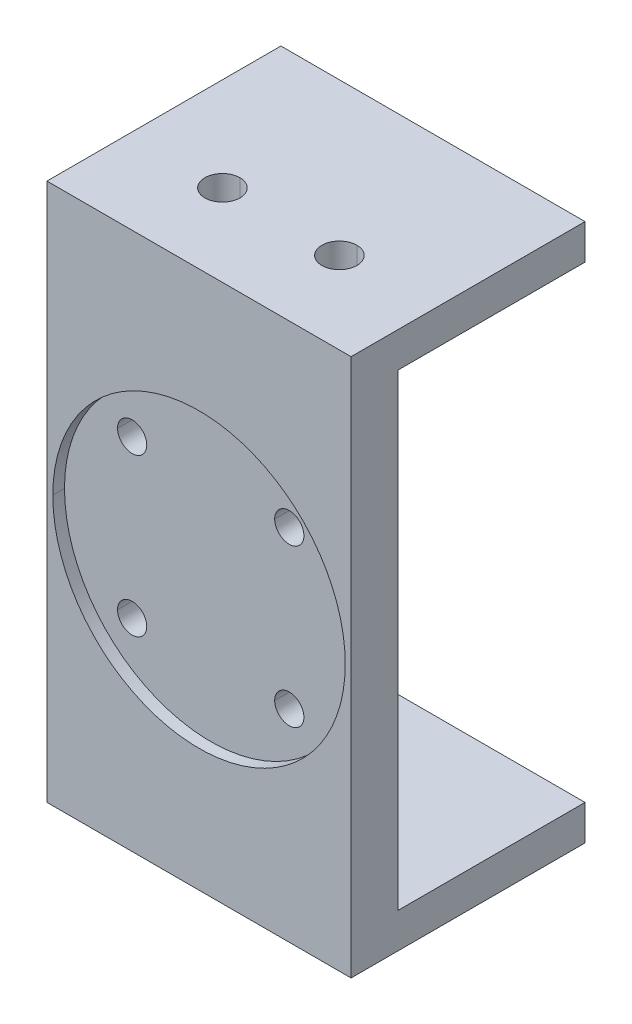
ISO-10303-21;
HEADER;
FILE_DESCRIPTION(('STEP AP214'),'2;1');
FILE_NAME('part.step','',(''),(''),'','','');
FILE_SCHEMA(('AUTOMOTIVE_DESIGN { 1 0 10303 214 1 1 1 1 }'));
ENDSEC;
DATA;
#1=APPLICATION_CONTEXT('core data for automotive mechanical design processes');
#2=APPLICATION_PROTOCOL_DEFINITION('international standard','automotive_design',2000,#1);
#3=PRODUCT_CONTEXT('',#1,'mechanical');
#4=PRODUCT('Part','Part','',(#3));
#5=PRODUCT_RELATED_PRODUCT_CATEGORY('part','',(#4));
#6=PRODUCT_DEFINITION_FORMATION('','',#4);
#7=PRODUCT_DEFINITION_CONTEXT('part definition',#1,'design');
#8=PRODUCT_DEFINITION('design','',#6,#7);
#9=PRODUCT_DEFINITION_SHAPE('','',#8);
#10=(LENGTH_UNIT() NAMED_UNIT(*) SI_UNIT(.MILLI.,.METRE.));
#11=(NAMED_UNIT(*) PLANE_ANGLE_UNIT() SI_UNIT($,.RADIAN.));
#12=(NAMED_UNIT(*) SI_UNIT($,.STERADIAN.) SOLID_ANGLE_UNIT());
#13=UNCERTAINTY_MEASURE_WITH_UNIT(LENGTH_MEASURE(1.E-05),#10,'distance_accuracy_value','');
#14=(GEOMETRIC_REPRESENTATION_CONTEXT(3) GLOBAL_UNCERTAINTY_ASSIGNED_CONTEXT((#13)) GLOBAL_UNIT_ASSIGNED_CONTEXT((#10,
#11,#12)) REPRESENTATION_CONTEXT('',''));
#15=CARTESIAN_POINT('',(0.,0.,0.));
#16=DIRECTION('',(0.,0.,1.));
#17=DIRECTION('',(1.,0.,0.));
#18=AXIS2_PLACEMENT_3D('',#15,#16,#17);
#19=CARTESIAN_POINT('',(-5.,-23.,-7.));
#20=DIRECTION('',(0.,1.,0.));
#21=DIRECTION('',(0.,0.,1.));
#22=AXIS2_PLACEMENT_3D('',#19,#20,#21);
#23=CYLINDRICAL_SURFACE('',#22,1.5);
#24=DIRECTION('',(0.,1.,0.));
#25=VECTOR('',#24,1.);
#26=CARTESIAN_POINT('',(-5.,-23.,-8.5));
#27=LINE('',#26,#25);
#28=CARTESIAN_POINT('',(-5.,-23.,-8.5));
#29=VERTEX_POINT('',#28);
#30=CARTESIAN_POINT('',(-5.,-20.,-8.5));
#31=VERTEX_POINT('',#30);
#32=EDGE_CURVE('E466',#29,#31,#27,.T.);
#33=ORIENTED_EDGE('',*,*,#32,.F.);
#34=CARTESIAN_POINT('',(-5.,-23.,-7.));
#35=DIRECTION('',(0.,1.,0.));
#36=DIRECTION('',(0.,0.,-1.));
#37=AXIS2_PLACEMENT_3D('',#34,#35,#36);
#38=CIRCLE('',#37,1.5);
#39=CARTESIAN_POINT('',(-5.,-23.,-5.5));
#40=VERTEX_POINT('',#39);
#41=EDGE_CURVE('E455',#40,#29,#38,.T.);
#42=ORIENTED_EDGE('',*,*,#41,.F.);
#43=DIRECTION('',(0.,1.,0.));
#44=VECTOR('',#43,1.);
#45=CARTESIAN_POINT('',(-5.,-23.,-5.5));
#46=LINE('',#45,#44);
#47=CARTESIAN_POINT('',(-5.,-20.,-5.5));
#48=VERTEX_POINT('',#47);
#49=EDGE_CURVE('E447',#40,#48,#46,.T.);
#50=ORIENTED_EDGE('',*,*,#49,.T.);
#51=CARTESIAN_POINT('',(-5.,-20.,-7.));
#52=DIRECTION('',(0.,-1.,0.));
#53=DIRECTION('',(0.,0.,-1.));
#54=AXIS2_PLACEMENT_3D('',#51,#52,#53);
#55=CIRCLE('',#54,1.5);
#56=EDGE_CURVE('E356',#31,#48,#55,.T.);
#57=ORIENTED_EDGE('',*,*,#56,.F.);
#58=EDGE_LOOP('',(#33,#42,#50,#57));
#59=FACE_BOUND('',#58,.T.);
#60=ADVANCED_FACE('F16',(#59),#23,.F.);
#61=CARTESIAN_POINT('',(-5.,-23.,-7.));
#62=DIRECTION('',(0.,1.,0.));
#63=DIRECTION('',(0.,0.,1.));
#64=AXIS2_PLACEMENT_3D('',#61,#62,#63);
#65=CYLINDRICAL_SURFACE('',#64,1.5);
#66=DIRECTION('',(0.,1.,0.));
#67=VECTOR('',#66,1.);
#68=CARTESIAN_POINT('',(-5.,-23.,-8.5));
#69=LINE('',#68,#67);
#70=CARTESIAN_POINT('',(-5.,20.,-8.5));
#71=VERTEX_POINT('',#70);
#72=CARTESIAN_POINT('',(-5.,23.,-8.5));
#73=VERTEX_POINT('',#72);
#74=EDGE_CURVE('E435',#71,#73,#69,.T.);
#75=ORIENTED_EDGE('',*,*,#74,.F.);
#76=CARTESIAN_POINT('',(-5.,20.,-7.));
#77=DIRECTION('',(0.,1.,0.));
#78=DIRECTION('',(0.,0.,1.));
#79=AXIS2_PLACEMENT_3D('',#76,#77,#78);
#80=CIRCLE('',#79,1.5);
#81=CARTESIAN_POINT('',(-5.,20.,-5.5));
#82=VERTEX_POINT('',#81);
#83=EDGE_CURVE('E307',#82,#71,#80,.T.);
#84=ORIENTED_EDGE('',*,*,#83,.F.);
#85=DIRECTION('',(0.,1.,0.));
#86=VECTOR('',#85,1.);
#87=CARTESIAN_POINT('',(-5.,-23.,-5.5));
#88=LINE('',#87,#86);
#89=CARTESIAN_POINT('',(-5.,23.,-5.5));
#90=VERTEX_POINT('',#89);
#91=EDGE_CURVE('E363',#82,#90,#88,.T.);
#92=ORIENTED_EDGE('',*,*,#91,.T.);
#93=CARTESIAN_POINT('',(-5.,23.,-7.));
#94=DIRECTION('',(0.,1.,0.));
#95=DIRECTION('',(0.,0.,-1.));
#96=AXIS2_PLACEMENT_3D('',#93,#94,#95);
#97=CIRCLE('',#96,1.5);
#98=EDGE_CURVE('E283',#90,#73,#97,.T.);
#99=ORIENTED_EDGE('',*,*,#98,.T.);
#100=EDGE_LOOP('',(#75,#84,#92,#99));
#101=FACE_BOUND('',#100,.T.);
#102=ADVANCED_FACE('F596',(#101),#65,.F.);
#103=CARTESIAN_POINT('',(5.,-23.,-7.));
#104=DIRECTION('',(0.,1.,0.));
#105=DIRECTION('',(0.,0.,1.));
#106=AXIS2_PLACEMENT_3D('',#103,#104,#105);
#107=CYLINDRICAL_SURFACE('',#106,1.5);
#108=DIRECTION('',(0.,1.,0.));
#109=VECTOR('',#108,1.);
#110=CARTESIAN_POINT('',(5.,-23.,-8.5));
#111=LINE('',#110,#109);
#112=CARTESIAN_POINT('',(5.,-23.,-8.5));
#113=VERTEX_POINT('',#112);
#114=CARTESIAN_POINT('',(5.,-20.,-8.5));
#115=VERTEX_POINT('',#114);
#116=EDGE_CURVE('E408',#113,#115,#111,.T.);
#117=ORIENTED_EDGE('',*,*,#116,.F.);
#118=CARTESIAN_POINT('',(5.,-23.,-7.));
#119=DIRECTION('',(0.,1.,0.));
#120=DIRECTION('',(0.,0.,1.));
#121=AXIS2_PLACEMENT_3D('',#118,#119,#120);
#122=CIRCLE('',#121,1.5);
#123=CARTESIAN_POINT('',(5.,-23.,-5.5));
#124=VERTEX_POINT('',#123);
#125=EDGE_CURVE('E517',#124,#113,#122,.T.);
#126=ORIENTED_EDGE('',*,*,#125,.F.);
#127=DIRECTION('',(0.,1.,0.));
#128=VECTOR('',#127,1.);
#129=CARTESIAN_POINT('',(5.,-23.,-5.5));
#130=LINE('',#129,#128);
#131=CARTESIAN_POINT('',(5.,-20.,-5.5));
#132=VERTEX_POINT('',#131);
#133=EDGE_CURVE('E301',#124,#132,#130,.T.);
#134=ORIENTED_EDGE('',*,*,#133,.T.);
#135=CARTESIAN_POINT('',(5.,-20.,-7.));
#136=DIRECTION('',(0.,-1.,0.));
#137=DIRECTION('',(0.,0.,-1.));
#138=AXIS2_PLACEMENT_3D('',#135,#136,#137);
#139=CIRCLE('',#138,1.5);
#140=EDGE_CURVE('E351',#115,#132,#139,.T.);
#141=ORIENTED_EDGE('',*,*,#140,.F.);
#142=EDGE_LOOP('',(#117,#126,#134,#141));
#143=FACE_BOUND('',#142,.T.);
#144=ADVANCED_FACE('F601',(#143),#107,.F.);
#145=CARTESIAN_POINT('',(5.,-23.,-7.));
#146=DIRECTION('',(0.,1.,0.));
#147=DIRECTION('',(0.,0.,1.));
#148=AXIS2_PLACEMENT_3D('',#145,#146,#147);
#149=CYLINDRICAL_SURFACE('',#148,1.5);
#150=DIRECTION('',(0.,1.,0.));
#151=VECTOR('',#150,1.);
#152=CARTESIAN_POINT('',(5.,-23.,-8.5));
#153=LINE('',#152,#151);
#154=CARTESIAN_POINT('',(5.,20.,-8.5));
#155=VERTEX_POINT('',#154);
#156=CARTESIAN_POINT('',(5.,23.,-8.5));
#157=VERTEX_POINT('',#156);
#158=EDGE_CURVE('E275',#155,#157,#153,.T.);
#159=ORIENTED_EDGE('',*,*,#158,.F.);
#160=CARTESIAN_POINT('',(5.,20.,-7.));
#161=DIRECTION('',(0.,1.,0.));
#162=DIRECTION('',(0.,0.,1.));
#163=AXIS2_PLACEMENT_3D('',#160,#161,#162);
#164=CIRCLE('',#163,1.5);
#165=CARTESIAN_POINT('',(5.,20.,-5.5));
#166=VERTEX_POINT('',#165);
#167=EDGE_CURVE('E310',#166,#155,#164,.T.);
#168=ORIENTED_EDGE('',*,*,#167,.F.);
#169=DIRECTION('',(0.,1.,0.));
#170=VECTOR('',#169,1.);
#171=CARTESIAN_POINT('',(5.,-23.,-5.5));
#172=LINE('',#171,#170);
#173=CARTESIAN_POINT('',(5.,23.,-5.5));
#174=VERTEX_POINT('',#173);
#175=EDGE_CURVE('E278',#166,#174,#172,.T.);
#176=ORIENTED_EDGE('',*,*,#175,.T.);
#177=CARTESIAN_POINT('',(5.,23.,-7.));
#178=DIRECTION('',(0.,1.,0.));
#179=DIRECTION('',(0.,0.,1.));
#180=AXIS2_PLACEMENT_3D('',#177,#178,#179);
#181=CIRCLE('',#180,1.5);
#182=EDGE_CURVE('E271',#174,#157,#181,.T.);
#183=ORIENTED_EDGE('',*,*,#182,.T.);
#184=EDGE_LOOP('',(#159,#168,#176,#183));
#185=FACE_BOUND('',#184,.T.);
#186=ADVANCED_FACE('F273',(#185),#149,.F.);
#187=CARTESIAN_POINT('',(-6.7175144212722,6.7175144212722,-1.));
#188=DIRECTION('',(0.,0.,1.));
#189=DIRECTION('',(1.,0.,0.));
#190=AXIS2_PLACEMENT_3D('',#187,#188,#189);
#191=CYLINDRICAL_SURFACE('',#190,1.25);
#192=DIRECTION('',(0.,0.,1.));
#193=VECTOR('',#192,1.);
#194=CARTESIAN_POINT('',(-7.9675144212722,6.7175144212722,-1.));
#195=LINE('',#194,#193);
#196=CARTESIAN_POINT('',(-7.9675144212722,6.7175144212722,-4.));
#197=VERTEX_POINT('',#196);
#198=CARTESIAN_POINT('',(-7.9675144212722,6.7175144212722,-1.));
#199=VERTEX_POINT('',#198);
#200=EDGE_CURVE('E311',#197,#199,#195,.T.);
#201=ORIENTED_EDGE('',*,*,#200,.F.);
#202=CARTESIAN_POINT('',(-6.7175144212722,6.7175144212722,-4.));
#203=DIRECTION('',(0.,0.,1.));
#204=DIRECTION('',(0.,-1.,0.));
#205=AXIS2_PLACEMENT_3D('',#202,#203,#204);
#206=CIRCLE('',#205,1.25);
#207=CARTESIAN_POINT('',(-5.46751442127221,6.7175144212722,-4.));
#208=VERTEX_POINT('',#207);
#209=EDGE_CURVE('E20',#208,#197,#206,.T.);
#210=ORIENTED_EDGE('',*,*,#209,.F.);
#211=DIRECTION('',(0.,0.,1.));
#212=VECTOR('',#211,1.);
#213=CARTESIAN_POINT('',(-5.46751442127221,6.7175144212722,-1.));
#214=LINE('',#213,#212);
#215=CARTESIAN_POINT('',(-5.4675144212722,6.7175144212722,-1.));
#216=VERTEX_POINT('',#215);
#217=EDGE_CURVE('E325',#208,#216,#214,.T.);
#218=ORIENTED_EDGE('',*,*,#217,.T.);
#219=CARTESIAN_POINT('',(-6.7175144212722,6.7175144212722,-1.));
#220=DIRECTION('',(0.,0.,1.));
#221=DIRECTION('',(1.,0.,0.));
#222=AXIS2_PLACEMENT_3D('',#219,#220,#221);
#223=CIRCLE('',#222,1.25);
#224=EDGE_CURVE('E305',#216,#199,#223,.T.);
#225=ORIENTED_EDGE('',*,*,#224,.T.);
#226=EDGE_LOOP('',(#201,#210,#218,#225));
#227=FACE_BOUND('',#226,.T.);
#228=ADVANCED_FACE('F636',(#227),#191,.F.);
#229=CARTESIAN_POINT('',(-6.7175144212722,-6.7175144212722,-1.));
#230=DIRECTION('',(0.,0.,1.));
#231=DIRECTION('',(1.,0.,0.));
#232=AXIS2_PLACEMENT_3D('',#229,#230,#231);
#233=CYLINDRICAL_SURFACE('',#232,1.25);
#234=DIRECTION('',(0.,0.,1.));
#235=VECTOR('',#234,1.);
#236=CARTESIAN_POINT('',(-7.9675144212722,-6.7175144212722,-1.));
#237=LINE('',#236,#235);
#238=CARTESIAN_POINT('',(-7.9675144212722,-6.7175144212722,-4.));
#239=VERTEX_POINT('',#238);
#240=CARTESIAN_POINT('',(-7.9675144212722,-6.7175144212722,-1.));
#241=VERTEX_POINT('',#240);
#242=EDGE_CURVE('E394',#239,#241,#237,.T.);
#243=ORIENTED_EDGE('',*,*,#242,.F.);
#244=CARTESIAN_POINT('',(-6.7175144212722,-6.7175144212722,-4.));
#245=DIRECTION('',(0.,0.,1.));
#246=DIRECTION('',(0.,-1.,0.));
#247=AXIS2_PLACEMENT_3D('',#244,#245,#246);
#248=CIRCLE('',#247,1.25);
#249=CARTESIAN_POINT('',(-5.46751442127221,-6.7175144212722,-4.));
#250=VERTEX_POINT('',#249);
#251=EDGE_CURVE('E338',#250,#239,#248,.T.);
#252=ORIENTED_EDGE('',*,*,#251,.F.);
#253=DIRECTION('',(0.,0.,1.));
#254=VECTOR('',#253,1.);
#255=CARTESIAN_POINT('',(-5.46751442127221,-6.7175144212722,-1.));
#256=LINE('',#255,#254);
#257=CARTESIAN_POINT('',(-5.4675144212722,-6.7175144212722,-1.));
#258=VERTEX_POINT('',#257);
#259=EDGE_CURVE('E335',#250,#258,#256,.T.);
#260=ORIENTED_EDGE('',*,*,#259,.T.);
#261=CARTESIAN_POINT('',(-6.7175144212722,-6.7175144212722,-1.));
#262=DIRECTION('',(0.,0.,1.));
#263=DIRECTION('',(1.,0.,0.));
#264=AXIS2_PLACEMENT_3D('',#261,#262,#263);
#265=CIRCLE('',#264,1.25);
#266=EDGE_CURVE('E345',#258,#241,#265,.T.);
#267=ORIENTED_EDGE('',*,*,#266,.T.);
#268=EDGE_LOOP('',(#243,#252,#260,#267));
#269=FACE_BOUND('',#268,.T.);
#270=ADVANCED_FACE('F633',(#269),#233,.F.);
#271=CARTESIAN_POINT('',(6.7175144212722,-6.7175144212722,-1.));
#272=DIRECTION('',(0.,0.,1.));
#273=DIRECTION('',(1.,0.,0.));
#274=AXIS2_PLACEMENT_3D('',#271,#272,#273);
#275=CYLINDRICAL_SURFACE('',#274,1.25);
#276=DIRECTION('',(0.,0.,1.));
#277=VECTOR('',#276,1.);
#278=CARTESIAN_POINT('',(5.46751442127221,-6.7175144212722,-1.));
#279=LINE('',#278,#277);
#280=CARTESIAN_POINT('',(5.46751442127221,-6.7175144212722,-4.));
#281=VERTEX_POINT('',#280);
#282=CARTESIAN_POINT('',(5.4675144212722,-6.7175144212722,-1.));
#283=VERTEX_POINT('',#282);
#284=EDGE_CURVE('E334',#281,#283,#279,.T.);
#285=ORIENTED_EDGE('',*,*,#284,.F.);
#286=CARTESIAN_POINT('',(6.7175144212722,-6.7175144212722,-4.));
#287=DIRECTION('',(0.,0.,1.));
#288=DIRECTION('',(0.,-1.,0.));
#289=AXIS2_PLACEMENT_3D('',#286,#287,#288);
#290=CIRCLE('',#289,1.25);
#291=CARTESIAN_POINT('',(7.9675144212722,-6.7175144212722,-4.));
#292=VERTEX_POINT('',#291);
#293=EDGE_CURVE('E206',#292,#281,#290,.T.);
#294=ORIENTED_EDGE('',*,*,#293,.F.);
#295=DIRECTION('',(0.,0.,1.));
#296=VECTOR('',#295,1.);
#297=CARTESIAN_POINT('',(7.9675144212722,-6.7175144212722,-1.));
#298=LINE('',#297,#296);
#299=CARTESIAN_POINT('',(7.9675144212722,-6.7175144212722,-1.));
#300=VERTEX_POINT('',#299);
#301=EDGE_CURVE('E350',#292,#300,#298,.T.);
#302=ORIENTED_EDGE('',*,*,#301,.T.);
#303=CARTESIAN_POINT('',(6.7175144212722,-6.7175144212722,-1.));
#304=DIRECTION('',(0.,0.,1.));
#305=DIRECTION('',(1.,0.,0.));
#306=AXIS2_PLACEMENT_3D('',#303,#304,#305);
#307=CIRCLE('',#306,1.25);
#308=EDGE_CURVE('E27',#300,#283,#307,.T.);
#309=ORIENTED_EDGE('',*,*,#308,.T.);
#310=EDGE_LOOP('',(#285,#294,#302,#309));
#311=FACE_BOUND('',#310,.T.);
#312=ADVANCED_FACE('F635',(#311),#275,.F.);
#313=CARTESIAN_POINT('',(6.7175144212722,6.71751442127221,-1.));
#314=DIRECTION('',(0.,0.,1.));
#315=DIRECTION('',(1.,0.,0.));
#316=AXIS2_PLACEMENT_3D('',#313,#314,#315);
#317=CYLINDRICAL_SURFACE('',#316,1.25);
#318=DIRECTION('',(0.,0.,1.));
#319=VECTOR('',#318,1.);
#320=CARTESIAN_POINT('',(5.46751442127221,6.71751442127221,-1.));
#321=LINE('',#320,#319);
#322=CARTESIAN_POINT('',(5.46751442127221,6.71751442127221,-4.));
#323=VERTEX_POINT('',#322);
#324=CARTESIAN_POINT('',(5.4675144212722,6.71751442127221,-1.));
#325=VERTEX_POINT('',#324);
#326=EDGE_CURVE('E362',#323,#325,#321,.T.);
#327=ORIENTED_EDGE('',*,*,#326,.F.);
#328=CARTESIAN_POINT('',(6.7175144212722,6.71751442127221,-4.));
#329=DIRECTION('',(0.,0.,1.));
#330=DIRECTION('',(0.,-1.,0.));
#331=AXIS2_PLACEMENT_3D('',#328,#329,#330);
#332=CIRCLE('',#331,1.25);
#333=CARTESIAN_POINT('',(7.9675144212722,6.71751442127221,-4.));
#334=VERTEX_POINT('',#333);
#335=EDGE_CURVE('E75',#334,#323,#332,.T.);
#336=ORIENTED_EDGE('',*,*,#335,.F.);
#337=DIRECTION('',(0.,0.,1.));
#338=VECTOR('',#337,1.);
#339=CARTESIAN_POINT('',(7.9675144212722,6.71751442127221,-1.));
#340=LINE('',#339,#338);
#341=CARTESIAN_POINT('',(7.9675144212722,6.71751442127221,-1.));
#342=VERTEX_POINT('',#341);
#343=EDGE_CURVE('E361',#334,#342,#340,.T.);
#344=ORIENTED_EDGE('',*,*,#343,.T.);
#345=CARTESIAN_POINT('',(6.7175144212722,6.71751442127221,-1.));
#346=DIRECTION('',(0.,0.,1.));
#347=DIRECTION('',(1.,0.,0.));
#348=AXIS2_PLACEMENT_3D('',#345,#346,#347);
#349=CIRCLE('',#348,1.25);
#350=EDGE_CURVE('E10',#342,#325,#349,.T.);
#351=ORIENTED_EDGE('',*,*,#350,.T.);
#352=EDGE_LOOP('',(#327,#336,#344,#351));
#353=FACE_BOUND('',#352,.T.);
#354=ADVANCED_FACE('F642',(#353),#317,.F.);
#355=CARTESIAN_POINT('',(0.,0.,-1.));
#356=DIRECTION('',(0.,0.,1.));
#357=DIRECTION('',(1.,0.,0.));
#358=AXIS2_PLACEMENT_3D('',#355,#356,#357);
#359=PLANE('',#358);
#360=ORIENTED_EDGE('',*,*,#350,.F.);
#361=CARTESIAN_POINT('',(6.7175144212722,6.71751442127221,-1.));
#362=DIRECTION('',(0.,0.,1.));
#363=DIRECTION('',(1.,0.,0.));
#364=AXIS2_PLACEMENT_3D('',#361,#362,#363);
#365=CIRCLE('',#364,1.25);
#366=EDGE_CURVE('E357',#325,#342,#365,.T.);
#367=ORIENTED_EDGE('',*,*,#366,.F.);
#368=EDGE_LOOP('',(#360,#367));
#369=FACE_BOUND('',#368,.T.);
#370=ORIENTED_EDGE('',*,*,#308,.F.);
#371=CARTESIAN_POINT('',(6.7175144212722,-6.7175144212722,-1.));
#372=DIRECTION('',(0.,0.,1.));
#373=DIRECTION('',(1.,0.,0.));
#374=AXIS2_PLACEMENT_3D('',#371,#372,#373);
#375=CIRCLE('',#374,1.25);
#376=EDGE_CURVE('E346',#283,#300,#375,.T.);
#377=ORIENTED_EDGE('',*,*,#376,.F.);
#378=EDGE_LOOP('',(#370,#377));
#379=FACE_BOUND('',#378,.T.);
#380=ORIENTED_EDGE('',*,*,#266,.F.);
#381=CARTESIAN_POINT('',(-6.7175144212722,-6.7175144212722,-1.));
#382=DIRECTION('',(0.,0.,1.));
#383=DIRECTION('',(1.,0.,0.));
#384=AXIS2_PLACEMENT_3D('',#381,#382,#383);
#385=CIRCLE('',#384,1.25);
#386=EDGE_CURVE('E398',#241,#258,#385,.T.);
#387=ORIENTED_EDGE('',*,*,#386,.F.);
#388=EDGE_LOOP('',(#380,#387));
#389=FACE_BOUND('',#388,.T.);
#390=ORIENTED_EDGE('',*,*,#224,.F.);
#391=CARTESIAN_POINT('',(-6.7175144212722,6.7175144212722,-1.));
#392=DIRECTION('',(0.,0.,1.));
#393=DIRECTION('',(1.,0.,0.));
#394=AXIS2_PLACEMENT_3D('',#391,#392,#393);
#395=CIRCLE('',#394,1.25);
#396=EDGE_CURVE('E315',#199,#216,#395,.T.);
#397=ORIENTED_EDGE('',*,*,#396,.F.);
#398=EDGE_LOOP('',(#390,#397));
#399=FACE_BOUND('',#398,.T.);
#400=CARTESIAN_POINT('',(0.,0.,-1.));
#401=DIRECTION('',(0.,0.,1.));
#402=DIRECTION('',(1.,0.,0.));
#403=AXIS2_PLACEMENT_3D('',#400,#401,#402);
#404=CIRCLE('',#403,12.5);
#405=CARTESIAN_POINT('',(12.5,0.,-1.));
#406=VERTEX_POINT('',#405);
#407=CARTESIAN_POINT('',(-12.5,0.,-1.));
#408=VERTEX_POINT('',#407);
#409=EDGE_CURVE('E282',#406,#408,#404,.T.);
#410=ORIENTED_EDGE('',*,*,#409,.T.);
#411=CARTESIAN_POINT('',(0.,0.,-1.));
#412=DIRECTION('',(0.,0.,1.));
#413=DIRECTION('',(1.,0.,0.));
#414=AXIS2_PLACEMENT_3D('',#411,#412,#413);
#415=CIRCLE('',#414,12.5);
#416=EDGE_CURVE('E321',#408,#406,#415,.T.);
#417=ORIENTED_EDGE('',*,*,#416,.T.);
#418=EDGE_LOOP('',(#410,#417));
#419=FACE_BOUND('',#418,.T.);
#420=ADVANCED_FACE('F628',(#369,#379,#389,#399,#419),#359,.T.);
#421=CARTESIAN_POINT('',(0.,0.,-1.));
#422=DIRECTION('',(0.,0.,1.));
#423=DIRECTION('',(1.,0.,0.));
#424=AXIS2_PLACEMENT_3D('',#421,#422,#423);
#425=CYLINDRICAL_SURFACE('',#424,12.5);
#426=DIRECTION('',(0.,0.,1.));
#427=VECTOR('',#426,1.);
#428=CARTESIAN_POINT('',(-12.5,0.,-1.));
#429=LINE('',#428,#427);
#430=CARTESIAN_POINT('',(-12.5,0.,0.));
#431=VERTEX_POINT('',#430);
#432=EDGE_CURVE('E317',#408,#431,#429,.T.);
#433=ORIENTED_EDGE('',*,*,#432,.F.);
#434=ORIENTED_EDGE('',*,*,#409,.F.);
#435=DIRECTION('',(0.,0.,1.));
#436=VECTOR('',#435,1.);
#437=CARTESIAN_POINT('',(12.5,0.,-1.));
#438=LINE('',#437,#436);
#439=CARTESIAN_POINT('',(12.5,0.,0.));
#440=VERTEX_POINT('',#439);
#441=EDGE_CURVE('E374',#406,#440,#438,.T.);
#442=ORIENTED_EDGE('',*,*,#441,.T.);
#443=CARTESIAN_POINT('',(0.,0.,0.));
#444=DIRECTION('',(0.,0.,1.));
#445=DIRECTION('',(1.,0.,0.));
#446=AXIS2_PLACEMENT_3D('',#443,#444,#445);
#447=CIRCLE('',#446,12.5);
#448=EDGE_CURVE('E369',#440,#431,#447,.T.);
#449=ORIENTED_EDGE('',*,*,#448,.T.);
#450=EDGE_LOOP('',(#433,#434,#442,#449));
#451=FACE_BOUND('',#450,.T.);
#452=ADVANCED_FACE('F624',(#451),#425,.F.);
#453=CARTESIAN_POINT('',(-13.,0.,0.));
#454=DIRECTION('',(-1.,0.,0.));
#455=DIRECTION('',(0.,0.,1.));
#456=AXIS2_PLACEMENT_3D('',#453,#454,#455);
#457=PLANE('',#456);
#458=DIRECTION('',(0.,-1.,0.));
#459=VECTOR('',#458,1.);
#460=CARTESIAN_POINT('',(-13.,23.,0.));
#461=LINE('',#460,#459);
#462=CARTESIAN_POINT('',(-13.,23.,0.));
#463=VERTEX_POINT('',#462);
#464=CARTESIAN_POINT('',(-13.,-23.,0.));
#465=VERTEX_POINT('',#464);
#466=EDGE_CURVE('E378',#463,#465,#461,.T.);
#467=ORIENTED_EDGE('',*,*,#466,.F.);
#468=DIRECTION('',(0.,0.,1.));
#469=VECTOR('',#468,1.);
#470=CARTESIAN_POINT('',(-13.,23.,0.));
#471=LINE('',#470,#469);
#472=CARTESIAN_POINT('',(-13.,23.,-20.));
#473=VERTEX_POINT('',#472);
#474=EDGE_CURVE('E392',#473,#463,#471,.T.);
#475=ORIENTED_EDGE('',*,*,#474,.F.);
#476=DIRECTION('',(0.,1.,0.));
#477=VECTOR('',#476,1.);
#478=CARTESIAN_POINT('',(-13.,23.,-20.));
#479=LINE('',#478,#477);
#480=CARTESIAN_POINT('',(-13.,20.,-20.));
#481=VERTEX_POINT('',#480);
#482=EDGE_CURVE('E497',#481,#473,#479,.T.);
#483=ORIENTED_EDGE('',*,*,#482,.F.);
#484=DIRECTION('',(0.,0.,-1.));
#485=VECTOR('',#484,1.);
#486=CARTESIAN_POINT('',(-13.,20.,-20.));
#487=LINE('',#486,#485);
#488=CARTESIAN_POINT('',(-13.,20.,-4.));
#489=VERTEX_POINT('',#488);
#490=EDGE_CURVE('E182',#489,#481,#487,.T.);
#491=ORIENTED_EDGE('',*,*,#490,.F.);
#492=DIRECTION('',(0.,1.,0.));
#493=VECTOR('',#492,1.);
#494=CARTESIAN_POINT('',(-13.,20.,-4.));
#495=LINE('',#494,#493);
#496=CARTESIAN_POINT('',(-13.,-20.,-4.));
#497=VERTEX_POINT('',#496);
#498=EDGE_CURVE('E355',#497,#489,#495,.T.);
#499=ORIENTED_EDGE('',*,*,#498,.F.);
#500=DIRECTION('',(0.,0.,1.));
#501=VECTOR('',#500,1.);
#502=CARTESIAN_POINT('',(-13.,-20.,-4.));
#503=LINE('',#502,#501);
#504=CARTESIAN_POINT('',(-13.,-20.,-20.));
#505=VERTEX_POINT('',#504);
#506=EDGE_CURVE('E402',#505,#497,#503,.T.);
#507=ORIENTED_EDGE('',*,*,#506,.F.);
#508=DIRECTION('',(0.,1.,0.));
#509=VECTOR('',#508,1.);
#510=CARTESIAN_POINT('',(-13.,-20.,-20.));
#511=LINE('',#510,#509);
#512=CARTESIAN_POINT('',(-13.,-23.,-20.));
#513=VERTEX_POINT('',#512);
#514=EDGE_CURVE('E384',#513,#505,#511,.T.);
#515=ORIENTED_EDGE('',*,*,#514,.F.);
#516=DIRECTION('',(0.,0.,-1.));
#517=VECTOR('',#516,1.);
#518=CARTESIAN_POINT('',(-13.,-23.,-20.));
#519=LINE('',#518,#517);
#520=EDGE_CURVE('E372',#465,#513,#519,.T.);
#521=ORIENTED_EDGE('',*,*,#520,.F.);
#522=EDGE_LOOP('',(#467,#475,#483,#491,#499,#507,#515,#521));
#523=FACE_BOUND('',#522,.T.);
#524=ADVANCED_FACE('F627',(#523),#457,.T.);
#525=CARTESIAN_POINT('',(13.,0.,0.));
#526=DIRECTION('',(-1.,0.,0.));
#527=DIRECTION('',(0.,0.,1.));
#528=AXIS2_PLACEMENT_3D('',#525,#526,#527);
#529=PLANE('',#528);
#530=DIRECTION('',(0.,-1.,0.));
#531=VECTOR('',#530,1.);
#532=CARTESIAN_POINT('',(13.,23.,0.));
#533=LINE('',#532,#531);
#534=CARTESIAN_POINT('',(13.,23.,0.));
#535=VERTEX_POINT('',#534);
#536=CARTESIAN_POINT('',(13.,-23.,0.));
#537=VERTEX_POINT('',#536);
#538=EDGE_CURVE('E421',#535,#537,#533,.T.);
#539=ORIENTED_EDGE('',*,*,#538,.T.);
#540=DIRECTION('',(0.,0.,-1.));
#541=VECTOR('',#540,1.);
#542=CARTESIAN_POINT('',(13.,-23.,-20.));
#543=LINE('',#542,#541);
#544=CARTESIAN_POINT('',(13.,-23.,-20.));
#545=VERTEX_POINT('',#544);
#546=EDGE_CURVE('E443',#537,#545,#543,.T.);
#547=ORIENTED_EDGE('',*,*,#546,.T.);
#548=DIRECTION('',(0.,1.,0.));
#549=VECTOR('',#548,1.);
#550=CARTESIAN_POINT('',(13.,-20.,-20.));
#551=LINE('',#550,#549);
#552=CARTESIAN_POINT('',(13.,-20.,-20.));
#553=VERTEX_POINT('',#552);
#554=EDGE_CURVE('E383',#545,#553,#551,.T.);
#555=ORIENTED_EDGE('',*,*,#554,.T.);
#556=DIRECTION('',(0.,0.,1.));
#557=VECTOR('',#556,1.);
#558=CARTESIAN_POINT('',(13.,-20.,-4.));
#559=LINE('',#558,#557);
#560=CARTESIAN_POINT('',(13.,-20.,-4.));
#561=VERTEX_POINT('',#560);
#562=EDGE_CURVE('E539',#553,#561,#559,.T.);
#563=ORIENTED_EDGE('',*,*,#562,.T.);
#564=DIRECTION('',(0.,1.,0.));
#565=VECTOR('',#564,1.);
#566=CARTESIAN_POINT('',(13.,20.,-4.));
#567=LINE('',#566,#565);
#568=CARTESIAN_POINT('',(13.,20.,-4.));
#569=VERTEX_POINT('',#568);
#570=EDGE_CURVE('E501',#561,#569,#567,.T.);
#571=ORIENTED_EDGE('',*,*,#570,.T.);
#572=DIRECTION('',(0.,0.,-1.));
#573=VECTOR('',#572,1.);
#574=CARTESIAN_POINT('',(13.,20.,-20.));
#575=LINE('',#574,#573);
#576=CARTESIAN_POINT('',(13.,20.,-20.));
#577=VERTEX_POINT('',#576);
#578=EDGE_CURVE('E168',#569,#577,#575,.T.);
#579=ORIENTED_EDGE('',*,*,#578,.T.);
#580=DIRECTION('',(0.,1.,0.));
#581=VECTOR('',#580,1.);
#582=CARTESIAN_POINT('',(13.,23.,-20.));
#583=LINE('',#582,#581);
#584=CARTESIAN_POINT('',(13.,23.,-20.));
#585=VERTEX_POINT('',#584);
#586=EDGE_CURVE('E389',#577,#585,#583,.T.);
#587=ORIENTED_EDGE('',*,*,#586,.T.);
#588=DIRECTION('',(0.,0.,1.));
#589=VECTOR('',#588,1.);
#590=CARTESIAN_POINT('',(13.,23.,0.));
#591=LINE('',#590,#589);
#592=EDGE_CURVE('E42',#585,#535,#591,.T.);
#593=ORIENTED_EDGE('',*,*,#592,.T.);
#594=EDGE_LOOP('',(#539,#547,#555,#563,#571,#579,#587,#593));
#595=FACE_BOUND('',#594,.T.);
#596=ADVANCED_FACE('F630',(#595),#529,.F.);
#597=CARTESIAN_POINT('',(13.,23.,0.));
#598=DIRECTION('',(0.,-1.,0.));
#599=DIRECTION('',(0.,0.,-1.));
#600=AXIS2_PLACEMENT_3D('',#597,#598,#599);
#601=PLANE('',#600);
#602=ORIENTED_EDGE('',*,*,#182,.F.);
#603=CARTESIAN_POINT('',(5.,23.,-7.));
#604=DIRECTION('',(0.,1.,0.));
#605=DIRECTION('',(0.,0.,1.));
#606=AXIS2_PLACEMENT_3D('',#603,#604,#605);
#607=CIRCLE('',#606,1.5);
#608=EDGE_CURVE('E285',#157,#174,#607,.T.);
#609=ORIENTED_EDGE('',*,*,#608,.F.);
#610=EDGE_LOOP('',(#602,#609));
#611=FACE_BOUND('',#610,.T.);
#612=ORIENTED_EDGE('',*,*,#98,.F.);
#613=CARTESIAN_POINT('',(-5.,23.,-7.));
#614=DIRECTION('',(0.,1.,0.));
#615=DIRECTION('',(0.,0.,-1.));
#616=AXIS2_PLACEMENT_3D('',#613,#614,#615);
#617=CIRCLE('',#616,1.5);
#618=EDGE_CURVE('E368',#73,#90,#617,.T.);
#619=ORIENTED_EDGE('',*,*,#618,.F.);
#620=EDGE_LOOP('',(#612,#619));
#621=FACE_BOUND('',#620,.T.);
#622=ORIENTED_EDGE('',*,*,#474,.T.);
#623=DIRECTION('',(-1.,0.,0.));
#624=VECTOR('',#623,1.);
#625=CARTESIAN_POINT('',(13.,23.,0.));
#626=LINE('',#625,#624);
#627=EDGE_CURVE('E373',#535,#463,#626,.T.);
#628=ORIENTED_EDGE('',*,*,#627,.F.);
#629=ORIENTED_EDGE('',*,*,#592,.F.);
#630=DIRECTION('',(-1.,0.,0.));
#631=VECTOR('',#630,1.);
#632=CARTESIAN_POINT('',(13.,23.,-20.));
#633=LINE('',#632,#631);
#634=EDGE_CURVE('E393',#585,#473,#633,.T.);
#635=ORIENTED_EDGE('',*,*,#634,.T.);
#636=EDGE_LOOP('',(#622,#628,#629,#635));
#637=FACE_BOUND('',#636,.T.);
#638=ADVANCED_FACE('F286',(#611,#621,#637),#601,.F.);
#639=CARTESIAN_POINT('',(13.,23.,-20.));
#640=DIRECTION('',(0.,0.,1.));
#641=DIRECTION('',(1.,0.,0.));
#642=AXIS2_PLACEMENT_3D('',#639,#640,#641);
#643=PLANE('',#642);
#644=ORIENTED_EDGE('',*,*,#482,.T.);
#645=ORIENTED_EDGE('',*,*,#634,.F.);
#646=ORIENTED_EDGE('',*,*,#586,.F.);
#647=DIRECTION('',(-1.,0.,0.));
#648=VECTOR('',#647,1.);
#649=CARTESIAN_POINT('',(13.,20.,-20.));
#650=LINE('',#649,#648);
#651=EDGE_CURVE('E385',#577,#481,#650,.T.);
#652=ORIENTED_EDGE('',*,*,#651,.T.);
#653=EDGE_LOOP('',(#644,#645,#646,#652));
#654=FACE_BOUND('',#653,.T.);
#655=ADVANCED_FACE('F617',(#654),#643,.F.);
#656=CARTESIAN_POINT('',(13.,20.,-20.));
#657=DIRECTION('',(0.,1.,0.));
#658=DIRECTION('',(0.,0.,-1.));
#659=AXIS2_PLACEMENT_3D('',#656,#657,#658);
#660=PLANE('',#659);
#661=ORIENTED_EDGE('',*,*,#167,.T.);
#662=CARTESIAN_POINT('',(5.,20.,-7.));
#663=DIRECTION('',(0.,1.,0.));
#664=DIRECTION('',(0.,0.,1.));
#665=AXIS2_PLACEMENT_3D('',#662,#663,#664);
#666=CIRCLE('',#665,1.5);
#667=EDGE_CURVE('E293',#155,#166,#666,.T.);
#668=ORIENTED_EDGE('',*,*,#667,.T.);
#669=EDGE_LOOP('',(#661,#668));
#670=FACE_BOUND('',#669,.T.);
#671=ORIENTED_EDGE('',*,*,#83,.T.);
#672=CARTESIAN_POINT('',(-5.,20.,-7.));
#673=DIRECTION('',(0.,1.,0.));
#674=DIRECTION('',(0.,0.,1.));
#675=AXIS2_PLACEMENT_3D('',#672,#673,#674);
#676=CIRCLE('',#675,1.5);
#677=EDGE_CURVE('E438',#71,#82,#676,.T.);
#678=ORIENTED_EDGE('',*,*,#677,.T.);
#679=EDGE_LOOP('',(#671,#678));
#680=FACE_BOUND('',#679,.T.);
#681=ORIENTED_EDGE('',*,*,#490,.T.);
#682=ORIENTED_EDGE('',*,*,#651,.F.);
#683=ORIENTED_EDGE('',*,*,#578,.F.);
#684=DIRECTION('',(-1.,0.,0.));
#685=VECTOR('',#684,1.);
#686=CARTESIAN_POINT('',(13.,20.,-4.));
#687=LINE('',#686,#685);
#688=EDGE_CURVE('E470',#569,#489,#687,.T.);
#689=ORIENTED_EDGE('',*,*,#688,.T.);
#690=EDGE_LOOP('',(#681,#682,#683,#689));
#691=FACE_BOUND('',#690,.T.);
#692=ADVANCED_FACE('F606',(#670,#680,#691),#660,.F.);
#693=CARTESIAN_POINT('',(13.,20.,-4.));
#694=DIRECTION('',(0.,0.,1.));
#695=DIRECTION('',(0.,-1.,0.));
#696=AXIS2_PLACEMENT_3D('',#693,#694,#695);
#697=PLANE('',#696);
#698=ORIENTED_EDGE('',*,*,#335,.T.);
#699=CARTESIAN_POINT('',(6.7175144212722,6.71751442127221,-4.));
#700=DIRECTION('',(0.,0.,1.));
#701=DIRECTION('',(0.,-1.,0.));
#702=AXIS2_PLACEMENT_3D('',#699,#700,#701);
#703=CIRCLE('',#702,1.25);
#704=EDGE_CURVE('E557',#323,#334,#703,.T.);
#705=ORIENTED_EDGE('',*,*,#704,.T.);
#706=EDGE_LOOP('',(#698,#705));
#707=FACE_BOUND('',#706,.T.);
#708=ORIENTED_EDGE('',*,*,#293,.T.);
#709=CARTESIAN_POINT('',(6.7175144212722,-6.7175144212722,-4.));
#710=DIRECTION('',(0.,0.,1.));
#711=DIRECTION('',(0.,-1.,0.));
#712=AXIS2_PLACEMENT_3D('',#709,#710,#711);
#713=CIRCLE('',#712,1.25);
#714=EDGE_CURVE('E330',#281,#292,#713,.T.);
#715=ORIENTED_EDGE('',*,*,#714,.T.);
#716=EDGE_LOOP('',(#708,#715));
#717=FACE_BOUND('',#716,.T.);
#718=ORIENTED_EDGE('',*,*,#251,.T.);
#719=CARTESIAN_POINT('',(-6.7175144212722,-6.7175144212722,-4.));
#720=DIRECTION('',(0.,0.,1.));
#721=DIRECTION('',(0.,-1.,0.));
#722=AXIS2_PLACEMENT_3D('',#719,#720,#721);
#723=CIRCLE('',#722,1.25);
#724=EDGE_CURVE('E329',#239,#250,#723,.T.);
#725=ORIENTED_EDGE('',*,*,#724,.T.);
#726=EDGE_LOOP('',(#718,#725));
#727=FACE_BOUND('',#726,.T.);
#728=ORIENTED_EDGE('',*,*,#209,.T.);
#729=CARTESIAN_POINT('',(-6.7175144212722,6.7175144212722,-4.));
#730=DIRECTION('',(0.,0.,1.));
#731=DIRECTION('',(0.,-1.,0.));
#732=AXIS2_PLACEMENT_3D('',#729,#730,#731);
#733=CIRCLE('',#732,1.25);
#734=EDGE_CURVE('E316',#197,#208,#733,.T.);
#735=ORIENTED_EDGE('',*,*,#734,.T.);
#736=EDGE_LOOP('',(#728,#735));
#737=FACE_BOUND('',#736,.T.);
#738=ORIENTED_EDGE('',*,*,#498,.T.);
#739=ORIENTED_EDGE('',*,*,#688,.F.);
#740=ORIENTED_EDGE('',*,*,#570,.F.);
#741=DIRECTION('',(-1.,0.,0.));
#742=VECTOR('',#741,1.);
#743=CARTESIAN_POINT('',(13.,-20.,-4.));
#744=LINE('',#743,#742);
#745=EDGE_CURVE('E480',#561,#497,#744,.T.);
#746=ORIENTED_EDGE('',*,*,#745,.T.);
#747=EDGE_LOOP('',(#738,#739,#740,#746));
#748=FACE_BOUND('',#747,.T.);
#749=ADVANCED_FACE('F652',(#707,#717,#727,#737,#748),#697,.F.);
#750=CARTESIAN_POINT('',(13.,-20.,-4.));
#751=DIRECTION('',(0.,-1.,0.));
#752=DIRECTION('',(0.,0.,-1.));
#753=AXIS2_PLACEMENT_3D('',#750,#751,#752);
#754=PLANE('',#753);
#755=CARTESIAN_POINT('',(5.,-20.,-7.));
#756=DIRECTION('',(0.,-1.,0.));
#757=DIRECTION('',(0.,0.,-1.));
#758=AXIS2_PLACEMENT_3D('',#755,#756,#757);
#759=CIRCLE('',#758,1.5);
#760=EDGE_CURVE('E342',#132,#115,#759,.T.);
#761=ORIENTED_EDGE('',*,*,#760,.T.);
#762=ORIENTED_EDGE('',*,*,#140,.T.);
#763=EDGE_LOOP('',(#761,#762));
#764=FACE_BOUND('',#763,.T.);
#765=CARTESIAN_POINT('',(-5.,-20.,-7.));
#766=DIRECTION('',(0.,-1.,0.));
#767=DIRECTION('',(0.,0.,-1.));
#768=AXIS2_PLACEMENT_3D('',#765,#766,#767);
#769=CIRCLE('',#768,1.5);
#770=EDGE_CURVE('E451',#48,#31,#769,.T.);
#771=ORIENTED_EDGE('',*,*,#770,.T.);
#772=ORIENTED_EDGE('',*,*,#56,.T.);
#773=EDGE_LOOP('',(#771,#772));
#774=FACE_BOUND('',#773,.T.);
#775=ORIENTED_EDGE('',*,*,#506,.T.);
#776=ORIENTED_EDGE('',*,*,#745,.F.);
#777=ORIENTED_EDGE('',*,*,#562,.F.);
#778=DIRECTION('',(-1.,0.,0.));
#779=VECTOR('',#778,1.);
#780=CARTESIAN_POINT('',(13.,-20.,-20.));
#781=LINE('',#780,#779);
#782=EDGE_CURVE('E379',#553,#505,#781,.T.);
#783=ORIENTED_EDGE('',*,*,#782,.T.);
#784=EDGE_LOOP('',(#775,#776,#777,#783));
#785=FACE_BOUND('',#784,.T.);
#786=ADVANCED_FACE('F578',(#764,#774,#785),#754,.F.);
#787=CARTESIAN_POINT('',(13.,-20.,-20.));
#788=DIRECTION('',(0.,0.,1.));
#789=DIRECTION('',(0.,-1.,0.));
#790=AXIS2_PLACEMENT_3D('',#787,#788,#789);
#791=PLANE('',#790);
#792=ORIENTED_EDGE('',*,*,#514,.T.);
#793=ORIENTED_EDGE('',*,*,#782,.F.);
#794=ORIENTED_EDGE('',*,*,#554,.F.);
#795=DIRECTION('',(-1.,0.,0.));
#796=VECTOR('',#795,1.);
#797=CARTESIAN_POINT('',(13.,-23.,-20.));
#798=LINE('',#797,#796);
#799=EDGE_CURVE('E439',#545,#513,#798,.T.);
#800=ORIENTED_EDGE('',*,*,#799,.T.);
#801=EDGE_LOOP('',(#792,#793,#794,#800));
#802=FACE_BOUND('',#801,.T.);
#803=ADVANCED_FACE('F615',(#802),#791,.F.);
#804=CARTESIAN_POINT('',(13.,-23.,-20.));
#805=DIRECTION('',(0.,1.,0.));
#806=DIRECTION('',(0.,0.,-1.));
#807=AXIS2_PLACEMENT_3D('',#804,#805,#806);
#808=PLANE('',#807);
#809=ORIENTED_EDGE('',*,*,#125,.T.);
#810=CARTESIAN_POINT('',(5.,-23.,-7.));
#811=DIRECTION('',(0.,1.,0.));
#812=DIRECTION('',(0.,0.,1.));
#813=AXIS2_PLACEMENT_3D('',#810,#811,#812);
#814=CIRCLE('',#813,1.5);
#815=EDGE_CURVE('E367',#113,#124,#814,.T.);
#816=ORIENTED_EDGE('',*,*,#815,.T.);
#817=EDGE_LOOP('',(#809,#816));
#818=FACE_BOUND('',#817,.T.);
#819=ORIENTED_EDGE('',*,*,#41,.T.);
#820=CARTESIAN_POINT('',(-5.,-23.,-7.));
#821=DIRECTION('',(0.,1.,0.));
#822=DIRECTION('',(0.,0.,-1.));
#823=AXIS2_PLACEMENT_3D('',#820,#821,#822);
#824=CIRCLE('',#823,1.5);
#825=EDGE_CURVE('E462',#29,#40,#824,.T.);
#826=ORIENTED_EDGE('',*,*,#825,.T.);
#827=EDGE_LOOP('',(#819,#826));
#828=FACE_BOUND('',#827,.T.);
#829=ORIENTED_EDGE('',*,*,#520,.T.);
#830=ORIENTED_EDGE('',*,*,#799,.F.);
#831=ORIENTED_EDGE('',*,*,#546,.F.);
#832=DIRECTION('',(-1.,0.,0.));
#833=VECTOR('',#832,1.);
#834=CARTESIAN_POINT('',(13.,-23.,0.));
#835=LINE('',#834,#833);
#836=EDGE_CURVE('E411',#537,#465,#835,.T.);
#837=ORIENTED_EDGE('',*,*,#836,.T.);
#838=EDGE_LOOP('',(#829,#830,#831,#837));
#839=FACE_BOUND('',#838,.T.);
#840=ADVANCED_FACE('F612',(#818,#828,#839),#808,.F.);
#841=CARTESIAN_POINT('',(13.,23.,0.));
#842=DIRECTION('',(0.,0.,-1.));
#843=DIRECTION('',(0.,-1.,0.));
#844=AXIS2_PLACEMENT_3D('',#841,#842,#843);
#845=PLANE('',#844);
#846=ORIENTED_EDGE('',*,*,#448,.F.);
#847=CARTESIAN_POINT('',(0.,0.,0.));
#848=DIRECTION('',(0.,0.,1.));
#849=DIRECTION('',(1.,0.,0.));
#850=AXIS2_PLACEMENT_3D('',#847,#848,#849);
#851=CIRCLE('',#850,12.5);
#852=EDGE_CURVE('E320',#431,#440,#851,.T.);
#853=ORIENTED_EDGE('',*,*,#852,.F.);
#854=EDGE_LOOP('',(#846,#853));
#855=FACE_BOUND('',#854,.T.);
#856=ORIENTED_EDGE('',*,*,#466,.T.);
#857=ORIENTED_EDGE('',*,*,#836,.F.);
#858=ORIENTED_EDGE('',*,*,#538,.F.);
#859=ORIENTED_EDGE('',*,*,#627,.T.);
#860=EDGE_LOOP('',(#856,#857,#858,#859));
#861=FACE_BOUND('',#860,.T.);
#862=ADVANCED_FACE('F18',(#855,#861),#845,.F.);
#863=CARTESIAN_POINT('',(0.,0.,-1.));
#864=DIRECTION('',(0.,0.,1.));
#865=DIRECTION('',(1.,0.,0.));
#866=AXIS2_PLACEMENT_3D('',#863,#864,#865);
#867=CYLINDRICAL_SURFACE('',#866,12.5);
#868=ORIENTED_EDGE('',*,*,#416,.F.);
#869=ORIENTED_EDGE('',*,*,#432,.T.);
#870=ORIENTED_EDGE('',*,*,#852,.T.);
#871=ORIENTED_EDGE('',*,*,#441,.F.);
#872=EDGE_LOOP('',(#868,#869,#870,#871));
#873=FACE_BOUND('',#872,.T.);
#874=ADVANCED_FACE('F607',(#873),#867,.F.);
#875=CARTESIAN_POINT('',(6.7175144212722,6.71751442127221,-1.));
#876=DIRECTION('',(0.,0.,1.));
#877=DIRECTION('',(1.,0.,0.));
#878=AXIS2_PLACEMENT_3D('',#875,#876,#877);
#879=CYLINDRICAL_SURFACE('',#878,1.25);
#880=ORIENTED_EDGE('',*,*,#704,.F.);
#881=ORIENTED_EDGE('',*,*,#326,.T.);
#882=ORIENTED_EDGE('',*,*,#366,.T.);
#883=ORIENTED_EDGE('',*,*,#343,.F.);
#884=EDGE_LOOP('',(#880,#881,#882,#883));
#885=FACE_BOUND('',#884,.T.);
#886=ADVANCED_FACE('F610',(#885),#879,.F.);
#887=CARTESIAN_POINT('',(6.7175144212722,-6.7175144212722,-1.));
#888=DIRECTION('',(0.,0.,1.));
#889=DIRECTION('',(1.,0.,0.));
#890=AXIS2_PLACEMENT_3D('',#887,#888,#889);
#891=CYLINDRICAL_SURFACE('',#890,1.25);
#892=ORIENTED_EDGE('',*,*,#714,.F.);
#893=ORIENTED_EDGE('',*,*,#284,.T.);
#894=ORIENTED_EDGE('',*,*,#376,.T.);
#895=ORIENTED_EDGE('',*,*,#301,.F.);
#896=EDGE_LOOP('',(#892,#893,#894,#895));
#897=FACE_BOUND('',#896,.T.);
#898=ADVANCED_FACE('F714',(#897),#891,.F.);
#899=CARTESIAN_POINT('',(-6.7175144212722,-6.7175144212722,-1.));
#900=DIRECTION('',(0.,0.,1.));
#901=DIRECTION('',(1.,0.,0.));
#902=AXIS2_PLACEMENT_3D('',#899,#900,#901);
#903=CYLINDRICAL_SURFACE('',#902,1.25);
#904=ORIENTED_EDGE('',*,*,#724,.F.);
#905=ORIENTED_EDGE('',*,*,#242,.T.);
#906=ORIENTED_EDGE('',*,*,#386,.T.);
#907=ORIENTED_EDGE('',*,*,#259,.F.);
#908=EDGE_LOOP('',(#904,#905,#906,#907));
#909=FACE_BOUND('',#908,.T.);
#910=ADVANCED_FACE('F650',(#909),#903,.F.);
#911=CARTESIAN_POINT('',(-6.7175144212722,6.7175144212722,-1.));
#912=DIRECTION('',(0.,0.,1.));
#913=DIRECTION('',(1.,0.,0.));
#914=AXIS2_PLACEMENT_3D('',#911,#912,#913);
#915=CYLINDRICAL_SURFACE('',#914,1.25);
#916=ORIENTED_EDGE('',*,*,#734,.F.);
#917=ORIENTED_EDGE('',*,*,#200,.T.);
#918=ORIENTED_EDGE('',*,*,#396,.T.);
#919=ORIENTED_EDGE('',*,*,#217,.F.);
#920=EDGE_LOOP('',(#916,#917,#918,#919));
#921=FACE_BOUND('',#920,.T.);
#922=ADVANCED_FACE('F705',(#921),#915,.F.);
#923=CARTESIAN_POINT('',(5.,-23.,-7.));
#924=DIRECTION('',(0.,1.,0.));
#925=DIRECTION('',(0.,0.,1.));
#926=AXIS2_PLACEMENT_3D('',#923,#924,#925);
#927=CYLINDRICAL_SURFACE('',#926,1.5);
#928=ORIENTED_EDGE('',*,*,#667,.F.);
#929=ORIENTED_EDGE('',*,*,#158,.T.);
#930=ORIENTED_EDGE('',*,*,#608,.T.);
#931=ORIENTED_EDGE('',*,*,#175,.F.);
#932=EDGE_LOOP('',(#928,#929,#930,#931));
#933=FACE_BOUND('',#932,.T.);
#934=ADVANCED_FACE('F291',(#933),#927,.F.);
#935=CARTESIAN_POINT('',(5.,-23.,-7.));
#936=DIRECTION('',(0.,1.,0.));
#937=DIRECTION('',(0.,0.,1.));
#938=AXIS2_PLACEMENT_3D('',#935,#936,#937);
#939=CYLINDRICAL_SURFACE('',#938,1.5);
#940=ORIENTED_EDGE('',*,*,#815,.F.);
#941=ORIENTED_EDGE('',*,*,#116,.T.);
#942=ORIENTED_EDGE('',*,*,#760,.F.);
#943=ORIENTED_EDGE('',*,*,#133,.F.);
#944=EDGE_LOOP('',(#940,#941,#942,#943));
#945=FACE_BOUND('',#944,.T.);
#946=ADVANCED_FACE('F590',(#945),#939,.F.);
#947=CARTESIAN_POINT('',(-5.,-23.,-7.));
#948=DIRECTION('',(0.,1.,0.));
#949=DIRECTION('',(0.,0.,1.));
#950=AXIS2_PLACEMENT_3D('',#947,#948,#949);
#951=CYLINDRICAL_SURFACE('',#950,1.5);
#952=ORIENTED_EDGE('',*,*,#677,.F.);
#953=ORIENTED_EDGE('',*,*,#74,.T.);
#954=ORIENTED_EDGE('',*,*,#618,.T.);
#955=ORIENTED_EDGE('',*,*,#91,.F.);
#956=EDGE_LOOP('',(#952,#953,#954,#955));
#957=FACE_BOUND('',#956,.T.);
#958=ADVANCED_FACE('F584',(#957),#951,.F.);
#959=CARTESIAN_POINT('',(-5.,-23.,-7.));
#960=DIRECTION('',(0.,1.,0.));
#961=DIRECTION('',(0.,0.,1.));
#962=AXIS2_PLACEMENT_3D('',#959,#960,#961);
#963=CYLINDRICAL_SURFACE('',#962,1.5);
#964=ORIENTED_EDGE('',*,*,#825,.F.);
#965=ORIENTED_EDGE('',*,*,#32,.T.);
#966=ORIENTED_EDGE('',*,*,#770,.F.);
#967=ORIENTED_EDGE('',*,*,#49,.F.);
#968=EDGE_LOOP('',(#964,#965,#966,#967));
#969=FACE_BOUND('',#968,.T.);
#970=ADVANCED_FACE('F582',(#969),#963,.F.);
#971=CLOSED_SHELL('',(#60,#102,#144,#186,#228,#270,#312,#354,#420,#452,#524,#596,#638,#655,#692,
#749,#786,#803,#840,#862,#874,#886,#898,#910,#922,#934,#946,#958,#970));
#972=MANIFOLD_SOLID_BREP('B1',#971);
#973=ADVANCED_BREP_SHAPE_REPRESENTATION('',(#18,#972),#14);
#974=SHAPE_DEFINITION_REPRESENTATION(#9,#973);
ENDSEC;
END-ISO-10303-21;
